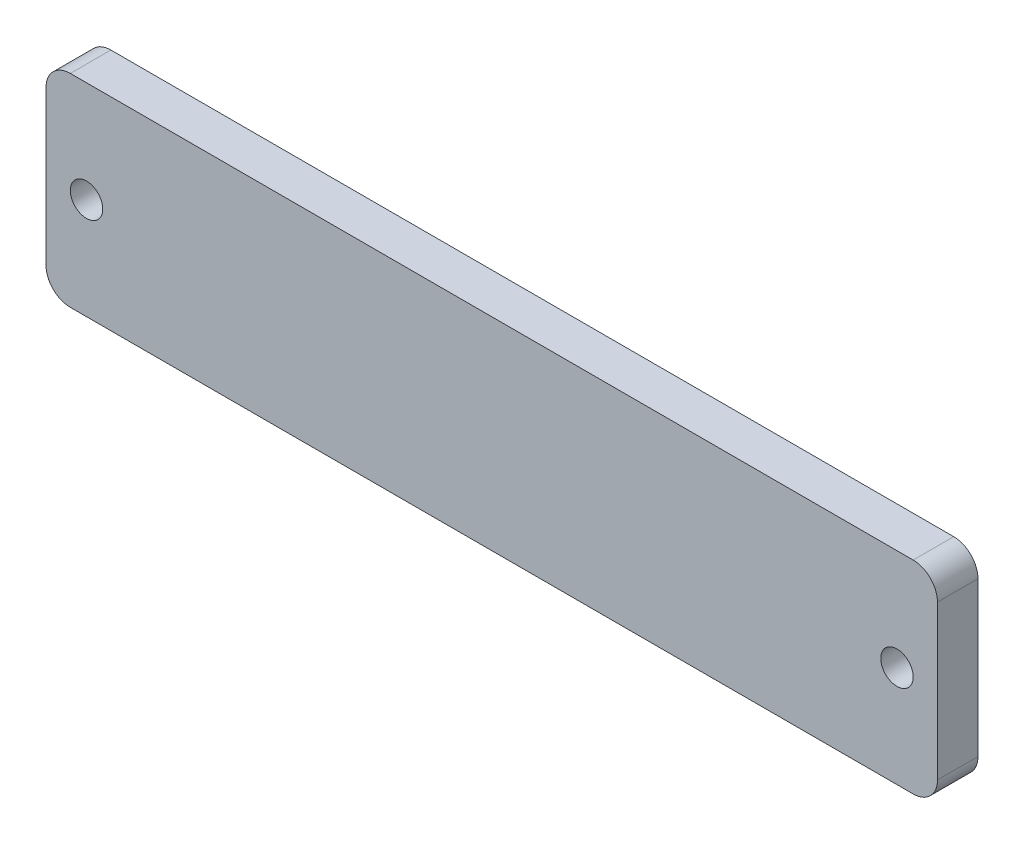
ISO-10303-21;
HEADER;
FILE_DESCRIPTION(('STEP AP214'),'2;1');
FILE_NAME('part.step','',(''),(''),'','','');
FILE_SCHEMA(('AUTOMOTIVE_DESIGN { 1 0 10303 214 1 1 1 1 }'));
ENDSEC;
DATA;
#1=APPLICATION_CONTEXT('core data for automotive mechanical design processes');
#2=APPLICATION_PROTOCOL_DEFINITION('international standard','automotive_design',2000,#1);
#3=PRODUCT_CONTEXT('',#1,'mechanical');
#4=PRODUCT('Part','Part','',(#3));
#5=PRODUCT_RELATED_PRODUCT_CATEGORY('part','',(#4));
#6=PRODUCT_DEFINITION_FORMATION('','',#4);
#7=PRODUCT_DEFINITION_CONTEXT('part definition',#1,'design');
#8=PRODUCT_DEFINITION('design','',#6,#7);
#9=PRODUCT_DEFINITION_SHAPE('','',#8);
#10=(LENGTH_UNIT() NAMED_UNIT(*) SI_UNIT(.MILLI.,.METRE.));
#11=(NAMED_UNIT(*) PLANE_ANGLE_UNIT() SI_UNIT($,.RADIAN.));
#12=(NAMED_UNIT(*) SI_UNIT($,.STERADIAN.) SOLID_ANGLE_UNIT());
#13=UNCERTAINTY_MEASURE_WITH_UNIT(LENGTH_MEASURE(1.E-05),#10,'distance_accuracy_value','');
#14=(GEOMETRIC_REPRESENTATION_CONTEXT(3) GLOBAL_UNCERTAINTY_ASSIGNED_CONTEXT((#13)) GLOBAL_UNIT_ASSIGNED_CONTEXT((#10,
#11,#12)) REPRESENTATION_CONTEXT('',''));
#15=CARTESIAN_POINT('',(0.,0.,0.));
#16=DIRECTION('',(0.,0.,1.));
#17=DIRECTION('',(1.,0.,0.));
#18=AXIS2_PLACEMENT_3D('',#15,#16,#17);
#19=CARTESIAN_POINT('',(52.,-9.5,-5.));
#20=DIRECTION('',(0.,0.,1.));
#21=DIRECTION('',(1.,0.,0.));
#22=AXIS2_PLACEMENT_3D('',#19,#20,#21);
#23=CYLINDRICAL_SURFACE('',#22,3.);
#24=CARTESIAN_POINT('',(52.,-9.5,0.));
#25=DIRECTION('',(0.,0.,1.));
#26=DIRECTION('',(1.,0.,0.));
#27=AXIS2_PLACEMENT_3D('',#24,#25,#26);
#28=CIRCLE('',#27,3.);
#29=CARTESIAN_POINT('',(52.,-12.5,0.));
#30=VERTEX_POINT('',#29);
#31=CARTESIAN_POINT('',(55.,-9.49999999999998,0.));
#32=VERTEX_POINT('',#31);
#33=EDGE_CURVE('E136',#30,#32,#28,.T.);
#34=ORIENTED_EDGE('',*,*,#33,.F.);
#35=DIRECTION('',(0.,0.,1.));
#36=VECTOR('',#35,1.);
#37=CARTESIAN_POINT('',(52.,-12.5,-5.));
#38=LINE('',#37,#36);
#39=CARTESIAN_POINT('',(52.,-12.5,-5.));
#40=VERTEX_POINT('',#39);
#41=EDGE_CURVE('E11',#40,#30,#38,.T.);
#42=ORIENTED_EDGE('',*,*,#41,.F.);
#43=CARTESIAN_POINT('',(52.,-9.5,-5.));
#44=DIRECTION('',(0.,0.,1.));
#45=DIRECTION('',(1.,0.,0.));
#46=AXIS2_PLACEMENT_3D('',#43,#44,#45);
#47=CIRCLE('',#46,3.);
#48=CARTESIAN_POINT('',(55.,-9.49999999999998,-5.));
#49=VERTEX_POINT('',#48);
#50=EDGE_CURVE('E157',#40,#49,#47,.T.);
#51=ORIENTED_EDGE('',*,*,#50,.T.);
#52=DIRECTION('',(0.,0.,1.));
#53=VECTOR('',#52,1.);
#54=CARTESIAN_POINT('',(55.,-9.49999999999998,-5.));
#55=LINE('',#54,#53);
#56=EDGE_CURVE('E42',#49,#32,#55,.T.);
#57=ORIENTED_EDGE('',*,*,#56,.T.);
#58=EDGE_LOOP('',(#34,#42,#51,#57));
#59=FACE_BOUND('',#58,.T.);
#60=ADVANCED_FACE('F39',(#59),#23,.T.);
#61=CARTESIAN_POINT('',(-52.,-12.5,-5.));
#62=DIRECTION('',(0.,-1.,0.));
#63=DIRECTION('',(0.,0.,-1.));
#64=AXIS2_PLACEMENT_3D('',#61,#62,#63);
#65=PLANE('',#64);
#66=DIRECTION('',(1.,0.,0.));
#67=VECTOR('',#66,1.);
#68=CARTESIAN_POINT('',(-52.,-12.5,0.));
#69=LINE('',#68,#67);
#70=CARTESIAN_POINT('',(-52.,-12.5,0.));
#71=VERTEX_POINT('',#70);
#72=EDGE_CURVE('E155',#71,#30,#69,.T.);
#73=ORIENTED_EDGE('',*,*,#72,.F.);
#74=DIRECTION('',(0.,0.,1.));
#75=VECTOR('',#74,1.);
#76=CARTESIAN_POINT('',(-52.,-12.5,-5.));
#77=LINE('',#76,#75);
#78=CARTESIAN_POINT('',(-52.,-12.5,-5.));
#79=VERTEX_POINT('',#78);
#80=EDGE_CURVE('E48',#79,#71,#77,.T.);
#81=ORIENTED_EDGE('',*,*,#80,.F.);
#82=DIRECTION('',(1.,0.,0.));
#83=VECTOR('',#82,1.);
#84=CARTESIAN_POINT('',(-52.,-12.5,-5.));
#85=LINE('',#84,#83);
#86=EDGE_CURVE('E126',#79,#40,#85,.T.);
#87=ORIENTED_EDGE('',*,*,#86,.T.);
#88=ORIENTED_EDGE('',*,*,#41,.T.);
#89=EDGE_LOOP('',(#73,#81,#87,#88));
#90=FACE_BOUND('',#89,.T.);
#91=ADVANCED_FACE('F169',(#90),#65,.T.);
#92=CARTESIAN_POINT('',(-52.,-9.5,-5.));
#93=DIRECTION('',(0.,0.,1.));
#94=DIRECTION('',(1.,0.,0.));
#95=AXIS2_PLACEMENT_3D('',#92,#93,#94);
#96=CYLINDRICAL_SURFACE('',#95,3.);
#97=CARTESIAN_POINT('',(-52.,-9.5,0.));
#98=DIRECTION('',(0.,0.,1.));
#99=DIRECTION('',(1.,0.,0.));
#100=AXIS2_PLACEMENT_3D('',#97,#98,#99);
#101=CIRCLE('',#100,3.);
#102=CARTESIAN_POINT('',(-55.,-9.49999999999998,0.));
#103=VERTEX_POINT('',#102);
#104=EDGE_CURVE('E113',#103,#71,#101,.T.);
#105=ORIENTED_EDGE('',*,*,#104,.F.);
#106=DIRECTION('',(0.,0.,1.));
#107=VECTOR('',#106,1.);
#108=CARTESIAN_POINT('',(-55.,-9.49999999999998,-5.));
#109=LINE('',#108,#107);
#110=CARTESIAN_POINT('',(-55.,-9.49999999999998,-5.));
#111=VERTEX_POINT('',#110);
#112=EDGE_CURVE('E108',#111,#103,#109,.T.);
#113=ORIENTED_EDGE('',*,*,#112,.F.);
#114=CARTESIAN_POINT('',(-52.,-9.5,-5.));
#115=DIRECTION('',(0.,0.,1.));
#116=DIRECTION('',(1.,0.,0.));
#117=AXIS2_PLACEMENT_3D('',#114,#115,#116);
#118=CIRCLE('',#117,3.);
#119=EDGE_CURVE('E111',#111,#79,#118,.T.);
#120=ORIENTED_EDGE('',*,*,#119,.T.);
#121=ORIENTED_EDGE('',*,*,#80,.T.);
#122=EDGE_LOOP('',(#105,#113,#120,#121));
#123=FACE_BOUND('',#122,.T.);
#124=ADVANCED_FACE('F110',(#123),#96,.T.);
#125=CARTESIAN_POINT('',(-55.,9.49999999999998,-5.));
#126=DIRECTION('',(-1.,0.,0.));
#127=DIRECTION('',(0.,0.,1.));
#128=AXIS2_PLACEMENT_3D('',#125,#126,#127);
#129=PLANE('',#128);
#130=DIRECTION('',(0.,-1.,0.));
#131=VECTOR('',#130,1.);
#132=CARTESIAN_POINT('',(-55.,9.49999999999998,0.));
#133=LINE('',#132,#131);
#134=CARTESIAN_POINT('',(-55.,9.49999999999998,0.));
#135=VERTEX_POINT('',#134);
#136=EDGE_CURVE('E152',#135,#103,#133,.T.);
#137=ORIENTED_EDGE('',*,*,#136,.F.);
#138=DIRECTION('',(0.,0.,1.));
#139=VECTOR('',#138,1.);
#140=CARTESIAN_POINT('',(-55.,9.49999999999998,-5.));
#141=LINE('',#140,#139);
#142=CARTESIAN_POINT('',(-55.,9.49999999999998,-5.));
#143=VERTEX_POINT('',#142);
#144=EDGE_CURVE('E118',#143,#135,#141,.T.);
#145=ORIENTED_EDGE('',*,*,#144,.F.);
#146=DIRECTION('',(0.,-1.,0.));
#147=VECTOR('',#146,1.);
#148=CARTESIAN_POINT('',(-55.,9.49999999999998,-5.));
#149=LINE('',#148,#147);
#150=EDGE_CURVE('E124',#143,#111,#149,.T.);
#151=ORIENTED_EDGE('',*,*,#150,.T.);
#152=ORIENTED_EDGE('',*,*,#112,.T.);
#153=EDGE_LOOP('',(#137,#145,#151,#152));
#154=FACE_BOUND('',#153,.T.);
#155=ADVANCED_FACE('F128',(#154),#129,.T.);
#156=CARTESIAN_POINT('',(-52.,9.5,-5.));
#157=DIRECTION('',(0.,0.,1.));
#158=DIRECTION('',(1.,0.,0.));
#159=AXIS2_PLACEMENT_3D('',#156,#157,#158);
#160=CYLINDRICAL_SURFACE('',#159,3.);
#161=CARTESIAN_POINT('',(-52.,9.5,0.));
#162=DIRECTION('',(0.,0.,1.));
#163=DIRECTION('',(1.,0.,0.));
#164=AXIS2_PLACEMENT_3D('',#161,#162,#163);
#165=CIRCLE('',#164,3.);
#166=CARTESIAN_POINT('',(-52.,12.5,0.));
#167=VERTEX_POINT('',#166);
#168=EDGE_CURVE('E149',#167,#135,#165,.T.);
#169=ORIENTED_EDGE('',*,*,#168,.F.);
#170=DIRECTION('',(0.,0.,1.));
#171=VECTOR('',#170,1.);
#172=CARTESIAN_POINT('',(-52.,12.5,-5.));
#173=LINE('',#172,#171);
#174=CARTESIAN_POINT('',(-52.,12.5,-5.));
#175=VERTEX_POINT('',#174);
#176=EDGE_CURVE('E161',#175,#167,#173,.T.);
#177=ORIENTED_EDGE('',*,*,#176,.F.);
#178=CARTESIAN_POINT('',(-52.,9.5,-5.));
#179=DIRECTION('',(0.,0.,1.));
#180=DIRECTION('',(1.,0.,0.));
#181=AXIS2_PLACEMENT_3D('',#178,#179,#180);
#182=CIRCLE('',#181,3.);
#183=EDGE_CURVE('E129',#175,#143,#182,.T.);
#184=ORIENTED_EDGE('',*,*,#183,.T.);
#185=ORIENTED_EDGE('',*,*,#144,.T.);
#186=EDGE_LOOP('',(#169,#177,#184,#185));
#187=FACE_BOUND('',#186,.T.);
#188=ADVANCED_FACE('F182',(#187),#160,.T.);
#189=CARTESIAN_POINT('',(-52.,12.5,-5.));
#190=DIRECTION('',(0.,1.,0.));
#191=DIRECTION('',(0.,0.,1.));
#192=AXIS2_PLACEMENT_3D('',#189,#190,#191);
#193=PLANE('',#192);
#194=DIRECTION('',(-1.,0.,0.));
#195=VECTOR('',#194,1.);
#196=CARTESIAN_POINT('',(-52.,12.5,0.));
#197=LINE('',#196,#195);
#198=CARTESIAN_POINT('',(52.,12.5,0.));
#199=VERTEX_POINT('',#198);
#200=EDGE_CURVE('E146',#199,#167,#197,.T.);
#201=ORIENTED_EDGE('',*,*,#200,.F.);
#202=DIRECTION('',(0.,0.,1.));
#203=VECTOR('',#202,1.);
#204=CARTESIAN_POINT('',(52.,12.5,-5.));
#205=LINE('',#204,#203);
#206=CARTESIAN_POINT('',(52.,12.5,-5.));
#207=VERTEX_POINT('',#206);
#208=EDGE_CURVE('E163',#207,#199,#205,.T.);
#209=ORIENTED_EDGE('',*,*,#208,.F.);
#210=DIRECTION('',(-1.,0.,0.));
#211=VECTOR('',#210,1.);
#212=CARTESIAN_POINT('',(-52.,12.5,-5.));
#213=LINE('',#212,#211);
#214=EDGE_CURVE('E131',#207,#175,#213,.T.);
#215=ORIENTED_EDGE('',*,*,#214,.T.);
#216=ORIENTED_EDGE('',*,*,#176,.T.);
#217=EDGE_LOOP('',(#201,#209,#215,#216));
#218=FACE_BOUND('',#217,.T.);
#219=ADVANCED_FACE('F185',(#218),#193,.T.);
#220=CARTESIAN_POINT('',(52.,9.5,-5.));
#221=DIRECTION('',(0.,0.,1.));
#222=DIRECTION('',(1.,0.,0.));
#223=AXIS2_PLACEMENT_3D('',#220,#221,#222);
#224=CYLINDRICAL_SURFACE('',#223,3.);
#225=CARTESIAN_POINT('',(52.,9.5,0.));
#226=DIRECTION('',(0.,0.,1.));
#227=DIRECTION('',(-1.,0.,0.));
#228=AXIS2_PLACEMENT_3D('',#225,#226,#227);
#229=CIRCLE('',#228,3.);
#230=CARTESIAN_POINT('',(55.,9.49999999999998,0.));
#231=VERTEX_POINT('',#230);
#232=EDGE_CURVE('E143',#231,#199,#229,.T.);
#233=ORIENTED_EDGE('',*,*,#232,.F.);
#234=DIRECTION('',(0.,0.,1.));
#235=VECTOR('',#234,1.);
#236=CARTESIAN_POINT('',(55.,9.49999999999998,-5.));
#237=LINE('',#236,#235);
#238=CARTESIAN_POINT('',(55.,9.49999999999998,-5.));
#239=VERTEX_POINT('',#238);
#240=EDGE_CURVE('E164',#239,#231,#237,.T.);
#241=ORIENTED_EDGE('',*,*,#240,.F.);
#242=CARTESIAN_POINT('',(52.,9.5,-5.));
#243=DIRECTION('',(0.,0.,1.));
#244=DIRECTION('',(-1.,0.,0.));
#245=AXIS2_PLACEMENT_3D('',#242,#243,#244);
#246=CIRCLE('',#245,3.);
#247=EDGE_CURVE('E231',#239,#207,#246,.T.);
#248=ORIENTED_EDGE('',*,*,#247,.T.);
#249=ORIENTED_EDGE('',*,*,#208,.T.);
#250=EDGE_LOOP('',(#233,#241,#248,#249));
#251=FACE_BOUND('',#250,.T.);
#252=ADVANCED_FACE('F189',(#251),#224,.T.);
#253=CARTESIAN_POINT('',(55.,9.49999999999998,-5.));
#254=DIRECTION('',(1.,0.,0.));
#255=DIRECTION('',(0.,1.,0.));
#256=AXIS2_PLACEMENT_3D('',#253,#254,#255);
#257=PLANE('',#256);
#258=DIRECTION('',(0.,1.,0.));
#259=VECTOR('',#258,1.);
#260=CARTESIAN_POINT('',(55.,9.49999999999998,0.));
#261=LINE('',#260,#259);
#262=EDGE_CURVE('E139',#32,#231,#261,.T.);
#263=ORIENTED_EDGE('',*,*,#262,.F.);
#264=ORIENTED_EDGE('',*,*,#56,.F.);
#265=DIRECTION('',(0.,1.,0.));
#266=VECTOR('',#265,1.);
#267=CARTESIAN_POINT('',(55.,9.49999999999998,-5.));
#268=LINE('',#267,#266);
#269=EDGE_CURVE('E229',#49,#239,#268,.T.);
#270=ORIENTED_EDGE('',*,*,#269,.T.);
#271=ORIENTED_EDGE('',*,*,#240,.T.);
#272=EDGE_LOOP('',(#263,#264,#270,#271));
#273=FACE_BOUND('',#272,.T.);
#274=ADVANCED_FACE('F166',(#273),#257,.T.);
#275=CARTESIAN_POINT('',(52.,-9.5,-5.));
#276=DIRECTION('',(0.,0.,1.));
#277=DIRECTION('',(1.,0.,0.));
#278=AXIS2_PLACEMENT_3D('',#275,#276,#277);
#279=PLANE('',#278);
#280=CARTESIAN_POINT('',(50.,0.,-5.));
#281=DIRECTION('',(0.,0.,1.));
#282=DIRECTION('',(1.,0.,0.));
#283=AXIS2_PLACEMENT_3D('',#280,#281,#282);
#284=CIRCLE('',#283,2.);
#285=CARTESIAN_POINT('',(52.,0.,-5.));
#286=VERTEX_POINT('',#285);
#287=EDGE_CURVE('E140',#286,#286,#284,.T.);
#288=ORIENTED_EDGE('',*,*,#287,.T.);
#289=EDGE_LOOP('',(#288));
#290=FACE_BOUND('',#289,.T.);
#291=CARTESIAN_POINT('',(-50.,0.,-5.));
#292=DIRECTION('',(0.,0.,1.));
#293=DIRECTION('',(1.,0.,0.));
#294=AXIS2_PLACEMENT_3D('',#291,#292,#293);
#295=CIRCLE('',#294,2.);
#296=CARTESIAN_POINT('',(-48.,0.,-5.));
#297=VERTEX_POINT('',#296);
#298=EDGE_CURVE('E223',#297,#297,#295,.T.);
#299=ORIENTED_EDGE('',*,*,#298,.T.);
#300=EDGE_LOOP('',(#299));
#301=FACE_BOUND('',#300,.T.);
#302=ORIENTED_EDGE('',*,*,#50,.F.);
#303=ORIENTED_EDGE('',*,*,#86,.F.);
#304=ORIENTED_EDGE('',*,*,#119,.F.);
#305=ORIENTED_EDGE('',*,*,#150,.F.);
#306=ORIENTED_EDGE('',*,*,#183,.F.);
#307=ORIENTED_EDGE('',*,*,#214,.F.);
#308=ORIENTED_EDGE('',*,*,#247,.F.);
#309=ORIENTED_EDGE('',*,*,#269,.F.);
#310=EDGE_LOOP('',(#302,#303,#304,#305,#306,#307,#308,#309));
#311=FACE_BOUND('',#310,.T.);
#312=ADVANCED_FACE('F122',(#290,#301,#311),#279,.F.);
#313=CARTESIAN_POINT('',(52.,-9.5,0.));
#314=DIRECTION('',(0.,0.,1.));
#315=DIRECTION('',(1.,0.,0.));
#316=AXIS2_PLACEMENT_3D('',#313,#314,#315);
#317=PLANE('',#316);
#318=CARTESIAN_POINT('',(50.,0.,0.));
#319=DIRECTION('',(0.,0.,1.));
#320=DIRECTION('',(1.,0.,0.));
#321=AXIS2_PLACEMENT_3D('',#318,#319,#320);
#322=CIRCLE('',#321,2.);
#323=CARTESIAN_POINT('',(52.,0.,0.));
#324=VERTEX_POINT('',#323);
#325=EDGE_CURVE('E218',#324,#324,#322,.T.);
#326=ORIENTED_EDGE('',*,*,#325,.F.);
#327=EDGE_LOOP('',(#326));
#328=FACE_BOUND('',#327,.T.);
#329=CARTESIAN_POINT('',(-50.,0.,0.));
#330=DIRECTION('',(0.,0.,1.));
#331=DIRECTION('',(1.,0.,0.));
#332=AXIS2_PLACEMENT_3D('',#329,#330,#331);
#333=CIRCLE('',#332,2.);
#334=CARTESIAN_POINT('',(-48.,0.,0.));
#335=VERTEX_POINT('',#334);
#336=EDGE_CURVE('E219',#335,#335,#333,.T.);
#337=ORIENTED_EDGE('',*,*,#336,.F.);
#338=EDGE_LOOP('',(#337));
#339=FACE_BOUND('',#338,.T.);
#340=ORIENTED_EDGE('',*,*,#33,.T.);
#341=ORIENTED_EDGE('',*,*,#262,.T.);
#342=ORIENTED_EDGE('',*,*,#232,.T.);
#343=ORIENTED_EDGE('',*,*,#200,.T.);
#344=ORIENTED_EDGE('',*,*,#168,.T.);
#345=ORIENTED_EDGE('',*,*,#136,.T.);
#346=ORIENTED_EDGE('',*,*,#104,.T.);
#347=ORIENTED_EDGE('',*,*,#72,.T.);
#348=EDGE_LOOP('',(#340,#341,#342,#343,#344,#345,#346,#347));
#349=FACE_BOUND('',#348,.T.);
#350=ADVANCED_FACE('F168',(#328,#339,#349),#317,.T.);
#351=CARTESIAN_POINT('',(-50.,0.,-5.));
#352=DIRECTION('',(0.,0.,1.));
#353=DIRECTION('',(1.,0.,0.));
#354=AXIS2_PLACEMENT_3D('',#351,#352,#353);
#355=CYLINDRICAL_SURFACE('',#354,2.);
#356=ORIENTED_EDGE('',*,*,#298,.F.);
#357=EDGE_LOOP('',(#356));
#358=FACE_BOUND('',#357,.T.);
#359=ORIENTED_EDGE('',*,*,#336,.T.);
#360=EDGE_LOOP('',(#359));
#361=FACE_BOUND('',#360,.T.);
#362=ADVANCED_FACE('F201',(#358,#361),#355,.F.);
#363=CARTESIAN_POINT('',(50.,0.,-5.));
#364=DIRECTION('',(0.,0.,1.));
#365=DIRECTION('',(1.,0.,0.));
#366=AXIS2_PLACEMENT_3D('',#363,#364,#365);
#367=CYLINDRICAL_SURFACE('',#366,2.);
#368=ORIENTED_EDGE('',*,*,#287,.F.);
#369=EDGE_LOOP('',(#368));
#370=FACE_BOUND('',#369,.T.);
#371=ORIENTED_EDGE('',*,*,#325,.T.);
#372=EDGE_LOOP('',(#371));
#373=FACE_BOUND('',#372,.T.);
#374=ADVANCED_FACE('F208',(#370,#373),#367,.F.);
#375=CLOSED_SHELL('',(#60,#91,#124,#155,#188,#219,#252,#274,#312,#350,#362,#374));
#376=MANIFOLD_SOLID_BREP('B2',#375);
#377=ADVANCED_BREP_SHAPE_REPRESENTATION('',(#18,#376),#14);
#378=SHAPE_DEFINITION_REPRESENTATION(#9,#377);
ENDSEC;
END-ISO-10303-21;
